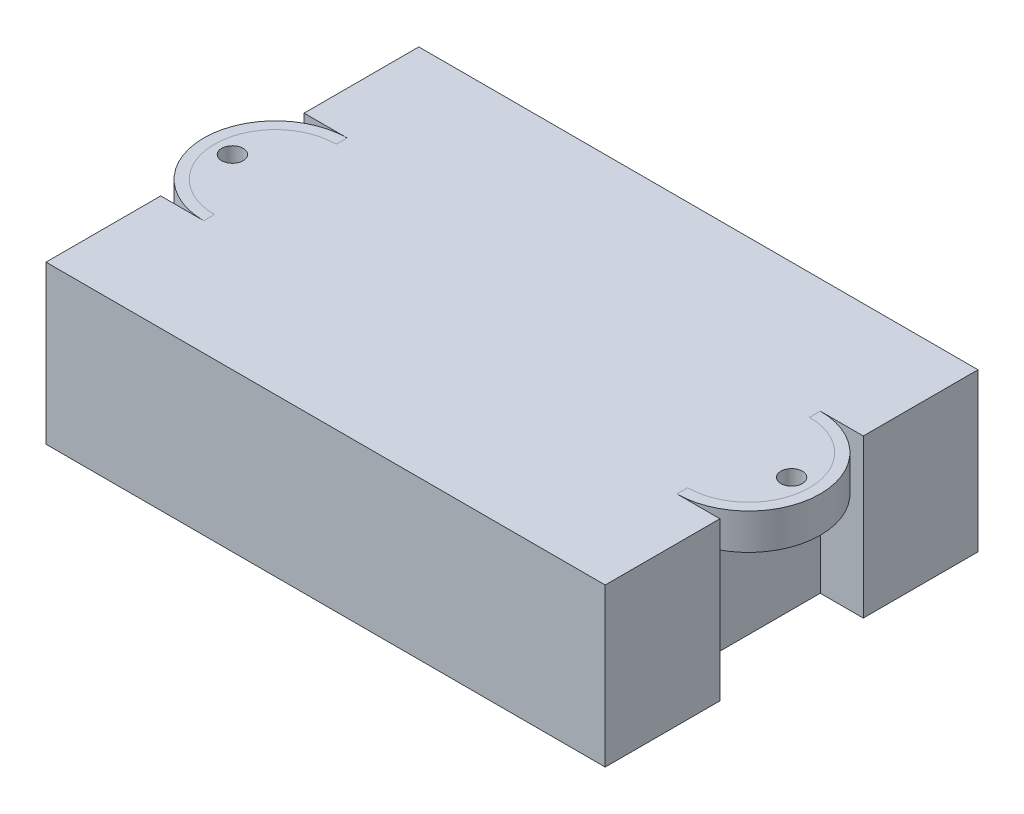
ISO-10303-21;
HEADER;
FILE_DESCRIPTION(('STEP AP214'),'2;1');
FILE_NAME('part.step','',(''),(''),'','','');
FILE_SCHEMA(('AUTOMOTIVE_DESIGN { 1 0 10303 214 1 1 1 1 }'));
ENDSEC;
DATA;
#1=APPLICATION_CONTEXT('core data for automotive mechanical design processes');
#2=APPLICATION_PROTOCOL_DEFINITION('international standard','automotive_design',2000,#1);
#3=PRODUCT_CONTEXT('',#1,'mechanical');
#4=PRODUCT('Part','Part','',(#3));
#5=PRODUCT_RELATED_PRODUCT_CATEGORY('part','',(#4));
#6=PRODUCT_DEFINITION_FORMATION('','',#4);
#7=PRODUCT_DEFINITION_CONTEXT('part definition',#1,'design');
#8=PRODUCT_DEFINITION('design','',#6,#7);
#9=PRODUCT_DEFINITION_SHAPE('','',#8);
#10=(LENGTH_UNIT() NAMED_UNIT(*) SI_UNIT(.MILLI.,.METRE.));
#11=(NAMED_UNIT(*) PLANE_ANGLE_UNIT() SI_UNIT($,.RADIAN.));
#12=(NAMED_UNIT(*) SI_UNIT($,.STERADIAN.) SOLID_ANGLE_UNIT());
#13=UNCERTAINTY_MEASURE_WITH_UNIT(LENGTH_MEASURE(1.E-05),#10,'distance_accuracy_value','');
#14=(GEOMETRIC_REPRESENTATION_CONTEXT(3) GLOBAL_UNCERTAINTY_ASSIGNED_CONTEXT((#13)) GLOBAL_UNIT_ASSIGNED_CONTEXT((#10,
#11,#12)) REPRESENTATION_CONTEXT('',''));
#15=CARTESIAN_POINT('',(0.,0.,0.));
#16=DIRECTION('',(0.,0.,1.));
#17=DIRECTION('',(1.,0.,0.));
#18=AXIS2_PLACEMENT_3D('',#15,#16,#17);
#19=CARTESIAN_POINT('',(-33.,17.,0.));
#20=DIRECTION('',(0.,1.,0.));
#21=DIRECTION('',(0.,0.,1.));
#22=AXIS2_PLACEMENT_3D('',#19,#20,#21);
#23=CYLINDRICAL_SURFACE('',#22,8.5);
#24=CARTESIAN_POINT('',(-33.,22.,0.));
#25=DIRECTION('',(0.,1.,0.));
#26=DIRECTION('',(0.,0.,1.));
#27=AXIS2_PLACEMENT_3D('',#24,#25,#26);
#28=CIRCLE('',#27,8.5);
#29=CARTESIAN_POINT('',(-33.,22.,-8.5));
#30=VERTEX_POINT('',#29);
#31=CARTESIAN_POINT('',(-33.,22.,8.5));
#32=VERTEX_POINT('',#31);
#33=EDGE_CURVE('E113',#30,#32,#28,.T.);
#34=ORIENTED_EDGE('',*,*,#33,.T.);
#35=DIRECTION('',(0.,1.,0.));
#36=VECTOR('',#35,1.);
#37=CARTESIAN_POINT('',(-33.,17.,8.5));
#38=LINE('',#37,#36);
#39=CARTESIAN_POINT('',(-33.,17.,8.5));
#40=VERTEX_POINT('',#39);
#41=EDGE_CURVE('E12',#40,#32,#38,.T.);
#42=ORIENTED_EDGE('',*,*,#41,.F.);
#43=CARTESIAN_POINT('',(-33.,17.,0.));
#44=DIRECTION('',(0.,1.,0.));
#45=DIRECTION('',(0.,0.,1.));
#46=AXIS2_PLACEMENT_3D('',#43,#44,#45);
#47=CIRCLE('',#46,8.5);
#48=CARTESIAN_POINT('',(-33.,17.,-8.5));
#49=VERTEX_POINT('',#48);
#50=EDGE_CURVE('E107',#49,#40,#47,.T.);
#51=ORIENTED_EDGE('',*,*,#50,.F.);
#52=DIRECTION('',(0.,1.,0.));
#53=VECTOR('',#52,1.);
#54=CARTESIAN_POINT('',(-33.,17.,-8.5));
#55=LINE('',#54,#53);
#56=EDGE_CURVE('E53',#49,#30,#55,.T.);
#57=ORIENTED_EDGE('',*,*,#56,.T.);
#58=EDGE_LOOP('',(#34,#42,#51,#57));
#59=FACE_BOUND('',#58,.T.);
#60=ADVANCED_FACE('F50',(#59),#23,.F.);
#61=CARTESIAN_POINT('',(-33.,17.,0.));
#62=DIRECTION('',(-1.,0.,0.));
#63=DIRECTION('',(0.,0.,1.));
#64=AXIS2_PLACEMENT_3D('',#61,#62,#63);
#65=PLANE('',#64);
#66=DIRECTION('',(0.,0.,1.));
#67=VECTOR('',#66,1.);
#68=CARTESIAN_POINT('',(-33.,22.,0.));
#69=LINE('',#68,#67);
#70=CARTESIAN_POINT('',(-33.,22.,10.));
#71=VERTEX_POINT('',#70);
#72=EDGE_CURVE('E89',#32,#71,#69,.T.);
#73=ORIENTED_EDGE('',*,*,#72,.T.);
#74=DIRECTION('',(0.,1.,0.));
#75=VECTOR('',#74,1.);
#76=CARTESIAN_POINT('',(-33.,17.,10.));
#77=LINE('',#76,#75);
#78=CARTESIAN_POINT('',(-33.,17.,10.));
#79=VERTEX_POINT('',#78);
#80=EDGE_CURVE('E59',#79,#71,#77,.T.);
#81=ORIENTED_EDGE('',*,*,#80,.F.);
#82=DIRECTION('',(0.,0.,1.));
#83=VECTOR('',#82,1.);
#84=CARTESIAN_POINT('',(-33.,17.,0.));
#85=LINE('',#84,#83);
#86=EDGE_CURVE('E67',#40,#79,#85,.T.);
#87=ORIENTED_EDGE('',*,*,#86,.F.);
#88=ORIENTED_EDGE('',*,*,#41,.T.);
#89=EDGE_LOOP('',(#73,#81,#87,#88));
#90=FACE_BOUND('',#89,.T.);
#91=ADVANCED_FACE('F121',(#90),#65,.F.);
#92=CARTESIAN_POINT('',(-33.,17.,0.));
#93=DIRECTION('',(0.,1.,0.));
#94=DIRECTION('',(0.,0.,1.));
#95=AXIS2_PLACEMENT_3D('',#92,#93,#94);
#96=CYLINDRICAL_SURFACE('',#95,10.);
#97=CARTESIAN_POINT('',(-33.,22.,0.));
#98=DIRECTION('',(0.,1.,0.));
#99=DIRECTION('',(0.,0.,1.));
#100=AXIS2_PLACEMENT_3D('',#97,#98,#99);
#101=CIRCLE('',#100,10.);
#102=CARTESIAN_POINT('',(-33.,22.,-10.));
#103=VERTEX_POINT('',#102);
#104=EDGE_CURVE('E101',#103,#71,#101,.T.);
#105=ORIENTED_EDGE('',*,*,#104,.F.);
#106=DIRECTION('',(0.,1.,0.));
#107=VECTOR('',#106,1.);
#108=CARTESIAN_POINT('',(-33.,17.,-10.));
#109=LINE('',#108,#107);
#110=CARTESIAN_POINT('',(-33.,17.,-10.));
#111=VERTEX_POINT('',#110);
#112=EDGE_CURVE('E98',#111,#103,#109,.T.);
#113=ORIENTED_EDGE('',*,*,#112,.F.);
#114=CARTESIAN_POINT('',(-33.,17.,0.));
#115=DIRECTION('',(0.,1.,0.));
#116=DIRECTION('',(0.,0.,1.));
#117=AXIS2_PLACEMENT_3D('',#114,#115,#116);
#118=CIRCLE('',#117,10.);
#119=EDGE_CURVE('E100',#111,#79,#118,.T.);
#120=ORIENTED_EDGE('',*,*,#119,.T.);
#121=ORIENTED_EDGE('',*,*,#80,.T.);
#122=EDGE_LOOP('',(#105,#113,#120,#121));
#123=FACE_BOUND('',#122,.T.);
#124=ADVANCED_FACE('F99',(#123),#96,.T.);
#125=EDGE_CURVE('E116',#103,#30,#69,.T.);
#126=ORIENTED_EDGE('',*,*,#125,.T.);
#127=ORIENTED_EDGE('',*,*,#56,.F.);
#128=EDGE_CURVE('E95',#111,#49,#85,.T.);
#129=ORIENTED_EDGE('',*,*,#128,.F.);
#130=ORIENTED_EDGE('',*,*,#112,.T.);
#131=EDGE_LOOP('',(#126,#127,#129,#130));
#132=FACE_BOUND('',#131,.T.);
#133=ADVANCED_FACE('F104',(#132),#65,.F.);
#134=CARTESIAN_POINT('',(0.,17.,0.));
#135=DIRECTION('',(0.,1.,0.));
#136=DIRECTION('',(0.,0.,1.));
#137=AXIS2_PLACEMENT_3D('',#134,#135,#136);
#138=PLANE('',#137);
#139=ORIENTED_EDGE('',*,*,#50,.T.);
#140=ORIENTED_EDGE('',*,*,#86,.T.);
#141=ORIENTED_EDGE('',*,*,#119,.F.);
#142=ORIENTED_EDGE('',*,*,#128,.T.);
#143=EDGE_LOOP('',(#139,#140,#141,#142));
#144=FACE_BOUND('',#143,.T.);
#145=ADVANCED_FACE('F109',(#144),#138,.F.);
#146=CARTESIAN_POINT('',(0.,22.,0.));
#147=DIRECTION('',(0.,1.,0.));
#148=DIRECTION('',(0.,0.,1.));
#149=AXIS2_PLACEMENT_3D('',#146,#147,#148);
#150=PLANE('',#149);
#151=ORIENTED_EDGE('',*,*,#33,.F.);
#152=ORIENTED_EDGE('',*,*,#125,.F.);
#153=ORIENTED_EDGE('',*,*,#104,.T.);
#154=ORIENTED_EDGE('',*,*,#72,.F.);
#155=EDGE_LOOP('',(#151,#152,#153,#154));
#156=FACE_BOUND('',#155,.T.);
#157=ADVANCED_FACE('F133',(#156),#150,.T.);
#158=CLOSED_SHELL('',(#60,#91,#124,#133,#145,#157));
#159=MANIFOLD_SOLID_BREP('B2',#158);
#160=CARTESIAN_POINT('',(33.,17.,0.));
#161=DIRECTION('',(1.,0.,0.));
#162=DIRECTION('',(0.,0.,-1.));
#163=AXIS2_PLACEMENT_3D('',#160,#161,#162);
#164=PLANE('',#163);
#165=DIRECTION('',(0.,0.,-1.));
#166=VECTOR('',#165,1.);
#167=CARTESIAN_POINT('',(33.,22.,0.));
#168=LINE('',#167,#166);
#169=CARTESIAN_POINT('',(33.,22.,-8.50000000000001));
#170=VERTEX_POINT('',#169);
#171=CARTESIAN_POINT('',(33.,22.,-9.99999999999999));
#172=VERTEX_POINT('',#171);
#173=EDGE_CURVE('E249',#170,#172,#168,.T.);
#174=ORIENTED_EDGE('',*,*,#173,.T.);
#175=DIRECTION('',(0.,1.,0.));
#176=VECTOR('',#175,1.);
#177=CARTESIAN_POINT('',(33.,17.,-9.99999999999999));
#178=LINE('',#177,#176);
#179=CARTESIAN_POINT('',(33.,17.,-9.99999999999999));
#180=VERTEX_POINT('',#179);
#181=EDGE_CURVE('E48',#180,#172,#178,.T.);
#182=ORIENTED_EDGE('',*,*,#181,.F.);
#183=DIRECTION('',(0.,0.,-1.));
#184=VECTOR('',#183,1.);
#185=CARTESIAN_POINT('',(33.,17.,0.));
#186=LINE('',#185,#184);
#187=CARTESIAN_POINT('',(33.,17.,-8.50000000000001));
#188=VERTEX_POINT('',#187);
#189=EDGE_CURVE('E240',#188,#180,#186,.T.);
#190=ORIENTED_EDGE('',*,*,#189,.F.);
#191=DIRECTION('',(0.,1.,0.));
#192=VECTOR('',#191,1.);
#193=CARTESIAN_POINT('',(33.,17.,-8.50000000000001));
#194=LINE('',#193,#192);
#195=EDGE_CURVE('E190',#188,#170,#194,.T.);
#196=ORIENTED_EDGE('',*,*,#195,.T.);
#197=EDGE_LOOP('',(#174,#182,#190,#196));
#198=FACE_BOUND('',#197,.T.);
#199=ADVANCED_FACE('F186',(#198),#164,.F.);
#200=CARTESIAN_POINT('',(33.,17.,0.));
#201=DIRECTION('',(0.,1.,0.));
#202=DIRECTION('',(0.,0.,1.));
#203=AXIS2_PLACEMENT_3D('',#200,#201,#202);
#204=CYLINDRICAL_SURFACE('',#203,10.);
#205=CARTESIAN_POINT('',(33.,22.,0.));
#206=DIRECTION('',(0.,1.,0.));
#207=DIRECTION('',(0.,0.,1.));
#208=AXIS2_PLACEMENT_3D('',#205,#206,#207);
#209=CIRCLE('',#208,10.);
#210=CARTESIAN_POINT('',(33.,22.,9.99999999999999));
#211=VERTEX_POINT('',#210);
#212=EDGE_CURVE('E218',#172,#211,#209,.F.);
#213=ORIENTED_EDGE('',*,*,#212,.T.);
#214=DIRECTION('',(0.,1.,0.));
#215=VECTOR('',#214,1.);
#216=CARTESIAN_POINT('',(33.,17.,9.99999999999999));
#217=LINE('',#216,#215);
#218=CARTESIAN_POINT('',(33.,17.,9.99999999999999));
#219=VERTEX_POINT('',#218);
#220=EDGE_CURVE('E196',#219,#211,#217,.T.);
#221=ORIENTED_EDGE('',*,*,#220,.F.);
#222=CARTESIAN_POINT('',(33.,17.,0.));
#223=DIRECTION('',(0.,1.,0.));
#224=DIRECTION('',(0.,0.,1.));
#225=AXIS2_PLACEMENT_3D('',#222,#223,#224);
#226=CIRCLE('',#225,10.);
#227=EDGE_CURVE('E204',#180,#219,#226,.F.);
#228=ORIENTED_EDGE('',*,*,#227,.F.);
#229=ORIENTED_EDGE('',*,*,#181,.T.);
#230=EDGE_LOOP('',(#213,#221,#228,#229));
#231=FACE_BOUND('',#230,.T.);
#232=ADVANCED_FACE('F258',(#231),#204,.T.);
#233=CARTESIAN_POINT('',(33.,22.,8.49999999999999));
#234=VERTEX_POINT('',#233);
#235=EDGE_CURVE('E244',#211,#234,#168,.T.);
#236=ORIENTED_EDGE('',*,*,#235,.T.);
#237=DIRECTION('',(0.,1.,0.));
#238=VECTOR('',#237,1.);
#239=CARTESIAN_POINT('',(33.,17.,8.49999999999999));
#240=LINE('',#239,#238);
#241=CARTESIAN_POINT('',(33.,17.,8.49999999999999));
#242=VERTEX_POINT('',#241);
#243=EDGE_CURVE('E242',#242,#234,#240,.T.);
#244=ORIENTED_EDGE('',*,*,#243,.F.);
#245=EDGE_CURVE('E234',#219,#242,#186,.T.);
#246=ORIENTED_EDGE('',*,*,#245,.F.);
#247=ORIENTED_EDGE('',*,*,#220,.T.);
#248=EDGE_LOOP('',(#236,#244,#246,#247));
#249=FACE_BOUND('',#248,.T.);
#250=ADVANCED_FACE('F243',(#249),#164,.F.);
#251=CARTESIAN_POINT('',(33.,17.,0.));
#252=DIRECTION('',(0.,1.,0.));
#253=DIRECTION('',(0.,0.,1.));
#254=AXIS2_PLACEMENT_3D('',#251,#252,#253);
#255=CYLINDRICAL_SURFACE('',#254,8.5);
#256=CARTESIAN_POINT('',(33.,22.,0.));
#257=DIRECTION('',(0.,1.,0.));
#258=DIRECTION('',(0.,0.,1.));
#259=AXIS2_PLACEMENT_3D('',#256,#257,#258);
#260=CIRCLE('',#259,8.5);
#261=EDGE_CURVE('E252',#170,#234,#260,.F.);
#262=ORIENTED_EDGE('',*,*,#261,.F.);
#263=ORIENTED_EDGE('',*,*,#195,.F.);
#264=CARTESIAN_POINT('',(33.,17.,0.));
#265=DIRECTION('',(0.,1.,0.));
#266=DIRECTION('',(0.,0.,1.));
#267=AXIS2_PLACEMENT_3D('',#264,#265,#266);
#268=CIRCLE('',#267,8.5);
#269=EDGE_CURVE('E237',#188,#242,#268,.F.);
#270=ORIENTED_EDGE('',*,*,#269,.T.);
#271=ORIENTED_EDGE('',*,*,#243,.T.);
#272=EDGE_LOOP('',(#262,#263,#270,#271));
#273=FACE_BOUND('',#272,.T.);
#274=ADVANCED_FACE('F188',(#273),#255,.F.);
#275=CARTESIAN_POINT('',(0.,17.,0.));
#276=DIRECTION('',(0.,1.,0.));
#277=DIRECTION('',(0.,0.,1.));
#278=AXIS2_PLACEMENT_3D('',#275,#276,#277);
#279=PLANE('',#278);
#280=ORIENTED_EDGE('',*,*,#189,.T.);
#281=ORIENTED_EDGE('',*,*,#227,.T.);
#282=ORIENTED_EDGE('',*,*,#245,.T.);
#283=ORIENTED_EDGE('',*,*,#269,.F.);
#284=EDGE_LOOP('',(#280,#281,#282,#283));
#285=FACE_BOUND('',#284,.T.);
#286=ADVANCED_FACE('F236',(#285),#279,.F.);
#287=CARTESIAN_POINT('',(0.,22.,0.));
#288=DIRECTION('',(0.,1.,0.));
#289=DIRECTION('',(0.,0.,1.));
#290=AXIS2_PLACEMENT_3D('',#287,#288,#289);
#291=PLANE('',#290);
#292=ORIENTED_EDGE('',*,*,#173,.F.);
#293=ORIENTED_EDGE('',*,*,#261,.T.);
#294=ORIENTED_EDGE('',*,*,#235,.F.);
#295=ORIENTED_EDGE('',*,*,#212,.F.);
#296=EDGE_LOOP('',(#292,#293,#294,#295));
#297=FACE_BOUND('',#296,.T.);
#298=ADVANCED_FACE('F255',(#297),#291,.T.);
#299=CLOSED_SHELL('',(#199,#232,#250,#274,#286,#298));
#300=MANIFOLD_SOLID_BREP('B6',#299);
#301=CARTESIAN_POINT('',(33.,0.,-9.99999999999999));
#302=DIRECTION('',(-1.,0.,0.));
#303=DIRECTION('',(0.,0.,1.));
#304=AXIS2_PLACEMENT_3D('',#301,#302,#303);
#305=PLANE('',#304);
#306=DIRECTION('',(0.,1.,0.));
#307=VECTOR('',#306,1.);
#308=CARTESIAN_POINT('',(33.,18.,8.49999999999999));
#309=LINE('',#308,#307);
#310=CARTESIAN_POINT('',(33.,18.,8.49999999999999));
#311=VERTEX_POINT('',#310);
#312=CARTESIAN_POINT('',(33.,22.,8.49999999999999));
#313=VERTEX_POINT('',#312);
#314=EDGE_CURVE('E465',#311,#313,#309,.T.);
#315=ORIENTED_EDGE('',*,*,#314,.T.);
#316=DIRECTION('',(0.,0.,1.));
#317=VECTOR('',#316,1.);
#318=CARTESIAN_POINT('',(33.,22.,-9.99999999999999));
#319=LINE('',#318,#317);
#320=CARTESIAN_POINT('',(33.,22.,9.99999999999999));
#321=VERTEX_POINT('',#320);
#322=EDGE_CURVE('E468',#313,#321,#319,.T.);
#323=ORIENTED_EDGE('',*,*,#322,.T.);
#324=DIRECTION('',(0.,1.,0.));
#325=VECTOR('',#324,1.);
#326=CARTESIAN_POINT('',(33.,0.,9.99999999999999));
#327=LINE('',#326,#325);
#328=CARTESIAN_POINT('',(33.,0.,9.99999999999999));
#329=VERTEX_POINT('',#328);
#330=EDGE_CURVE('E504',#329,#321,#327,.T.);
#331=ORIENTED_EDGE('',*,*,#330,.F.);
#332=DIRECTION('',(0.,0.,1.));
#333=VECTOR('',#332,1.);
#334=CARTESIAN_POINT('',(33.,0.,-9.99999999999999));
#335=LINE('',#334,#333);
#336=CARTESIAN_POINT('',(33.,0.,-9.99999999999999));
#337=VERTEX_POINT('',#336);
#338=EDGE_CURVE('E494',#337,#329,#335,.T.);
#339=ORIENTED_EDGE('',*,*,#338,.F.);
#340=DIRECTION('',(0.,1.,0.));
#341=VECTOR('',#340,1.);
#342=CARTESIAN_POINT('',(33.,0.,-9.99999999999999));
#343=LINE('',#342,#341);
#344=CARTESIAN_POINT('',(33.,22.,-9.99999999999999));
#345=VERTEX_POINT('',#344);
#346=EDGE_CURVE('E482',#337,#345,#343,.T.);
#347=ORIENTED_EDGE('',*,*,#346,.T.);
#348=CARTESIAN_POINT('',(33.,22.,-8.50000000000001));
#349=VERTEX_POINT('',#348);
#350=EDGE_CURVE('E505',#345,#349,#319,.T.);
#351=ORIENTED_EDGE('',*,*,#350,.T.);
#352=DIRECTION('',(0.,1.,0.));
#353=VECTOR('',#352,1.);
#354=CARTESIAN_POINT('',(33.,18.,-8.50000000000001));
#355=LINE('',#354,#353);
#356=CARTESIAN_POINT('',(33.,18.,-8.50000000000001));
#357=VERTEX_POINT('',#356);
#358=EDGE_CURVE('E460',#357,#349,#355,.T.);
#359=ORIENTED_EDGE('',*,*,#358,.F.);
#360=DIRECTION('',(0.,0.,-1.));
#361=VECTOR('',#360,1.);
#362=CARTESIAN_POINT('',(33.,18.,0.));
#363=LINE('',#362,#361);
#364=EDGE_CURVE('E453',#311,#357,#363,.T.);
#365=ORIENTED_EDGE('',*,*,#364,.F.);
#366=EDGE_LOOP('',(#315,#323,#331,#339,#347,#351,#359,#365));
#367=FACE_BOUND('',#366,.T.);
#368=ADVANCED_FACE('F307',(#367),#305,.F.);
#369=CARTESIAN_POINT('',(39.,22.,-26.));
#370=DIRECTION('',(-1.,0.,0.));
#371=DIRECTION('',(0.,0.,1.));
#372=AXIS2_PLACEMENT_3D('',#369,#370,#371);
#373=PLANE('',#372);
#374=DIRECTION('',(0.,0.,-1.));
#375=VECTOR('',#374,1.);
#376=CARTESIAN_POINT('',(39.,22.,-26.));
#377=LINE('',#376,#375);
#378=CARTESIAN_POINT('',(39.,22.,-9.99999999999999));
#379=VERTEX_POINT('',#378);
#380=CARTESIAN_POINT('',(39.,22.,-26.));
#381=VERTEX_POINT('',#380);
#382=EDGE_CURVE('E523',#379,#381,#377,.T.);
#383=ORIENTED_EDGE('',*,*,#382,.F.);
#384=DIRECTION('',(0.,1.,0.));
#385=VECTOR('',#384,1.);
#386=CARTESIAN_POINT('',(39.,0.,-9.99999999999999));
#387=LINE('',#386,#385);
#388=CARTESIAN_POINT('',(39.,0.,-9.99999999999999));
#389=VERTEX_POINT('',#388);
#390=EDGE_CURVE('E512',#389,#379,#387,.T.);
#391=ORIENTED_EDGE('',*,*,#390,.F.);
#392=DIRECTION('',(0.,0.,-1.));
#393=VECTOR('',#392,1.);
#394=CARTESIAN_POINT('',(39.,0.,-26.));
#395=LINE('',#394,#393);
#396=CARTESIAN_POINT('',(39.,0.,-26.));
#397=VERTEX_POINT('',#396);
#398=EDGE_CURVE('E488',#389,#397,#395,.T.);
#399=ORIENTED_EDGE('',*,*,#398,.T.);
#400=DIRECTION('',(0.,-1.,0.));
#401=VECTOR('',#400,1.);
#402=CARTESIAN_POINT('',(39.,22.,-26.));
#403=LINE('',#402,#401);
#404=EDGE_CURVE('E184',#381,#397,#403,.T.);
#405=ORIENTED_EDGE('',*,*,#404,.F.);
#406=EDGE_LOOP('',(#383,#391,#399,#405));
#407=FACE_BOUND('',#406,.T.);
#408=ADVANCED_FACE('F566',(#407),#373,.F.);
#409=CARTESIAN_POINT('',(-39.,22.,-26.));
#410=DIRECTION('',(1.,0.,0.));
#411=DIRECTION('',(0.,0.,-1.));
#412=AXIS2_PLACEMENT_3D('',#409,#410,#411);
#413=PLANE('',#412);
#414=DIRECTION('',(0.,0.,1.));
#415=VECTOR('',#414,1.);
#416=CARTESIAN_POINT('',(-39.,0.,-26.));
#417=LINE('',#416,#415);
#418=CARTESIAN_POINT('',(-39.,0.,-26.));
#419=VERTEX_POINT('',#418);
#420=CARTESIAN_POINT('',(-39.,0.,-10.));
#421=VERTEX_POINT('',#420);
#422=EDGE_CURVE('E537',#419,#421,#417,.T.);
#423=ORIENTED_EDGE('',*,*,#422,.T.);
#424=DIRECTION('',(0.,1.,0.));
#425=VECTOR('',#424,1.);
#426=CARTESIAN_POINT('',(-39.,0.,-10.));
#427=LINE('',#426,#425);
#428=CARTESIAN_POINT('',(-39.,22.,-10.));
#429=VERTEX_POINT('',#428);
#430=EDGE_CURVE('E485',#421,#429,#427,.T.);
#431=ORIENTED_EDGE('',*,*,#430,.T.);
#432=DIRECTION('',(0.,0.,1.));
#433=VECTOR('',#432,1.);
#434=CARTESIAN_POINT('',(-39.,22.,-26.));
#435=LINE('',#434,#433);
#436=CARTESIAN_POINT('',(-39.,22.,-26.));
#437=VERTEX_POINT('',#436);
#438=EDGE_CURVE('E526',#437,#429,#435,.T.);
#439=ORIENTED_EDGE('',*,*,#438,.F.);
#440=DIRECTION('',(0.,-1.,0.));
#441=VECTOR('',#440,1.);
#442=CARTESIAN_POINT('',(-39.,22.,-26.));
#443=LINE('',#442,#441);
#444=EDGE_CURVE('E315',#437,#419,#443,.T.);
#445=ORIENTED_EDGE('',*,*,#444,.T.);
#446=EDGE_LOOP('',(#423,#431,#439,#445));
#447=FACE_BOUND('',#446,.T.);
#448=ADVANCED_FACE('F551',(#447),#413,.F.);
#449=CARTESIAN_POINT('',(39.,0.,26.));
#450=VERTEX_POINT('',#449);
#451=CARTESIAN_POINT('',(39.,0.,9.99999999999998));
#452=VERTEX_POINT('',#451);
#453=EDGE_CURVE('E531',#450,#452,#395,.T.);
#454=ORIENTED_EDGE('',*,*,#453,.T.);
#455=DIRECTION('',(0.,1.,0.));
#456=VECTOR('',#455,1.);
#457=CARTESIAN_POINT('',(39.,0.,9.99999999999999));
#458=LINE('',#457,#456);
#459=CARTESIAN_POINT('',(39.,22.,9.99999999999999));
#460=VERTEX_POINT('',#459);
#461=EDGE_CURVE('E514',#452,#460,#458,.T.);
#462=ORIENTED_EDGE('',*,*,#461,.T.);
#463=CARTESIAN_POINT('',(39.,22.,26.));
#464=VERTEX_POINT('',#463);
#465=EDGE_CURVE('E519',#464,#460,#377,.T.);
#466=ORIENTED_EDGE('',*,*,#465,.F.);
#467=DIRECTION('',(0.,-1.,0.));
#468=VECTOR('',#467,1.);
#469=CARTESIAN_POINT('',(39.,22.,26.));
#470=LINE('',#469,#468);
#471=EDGE_CURVE('E530',#464,#450,#470,.T.);
#472=ORIENTED_EDGE('',*,*,#471,.T.);
#473=EDGE_LOOP('',(#454,#462,#466,#472));
#474=FACE_BOUND('',#473,.T.);
#475=ADVANCED_FACE('F309',(#474),#373,.F.);
#476=CARTESIAN_POINT('',(-39.,22.,-26.));
#477=DIRECTION('',(0.,0.,1.));
#478=DIRECTION('',(1.,0.,0.));
#479=AXIS2_PLACEMENT_3D('',#476,#477,#478);
#480=PLANE('',#479);
#481=DIRECTION('',(-1.,0.,0.));
#482=VECTOR('',#481,1.);
#483=CARTESIAN_POINT('',(-39.,0.,-26.));
#484=LINE('',#483,#482);
#485=EDGE_CURVE('E534',#397,#419,#484,.T.);
#486=ORIENTED_EDGE('',*,*,#485,.T.);
#487=ORIENTED_EDGE('',*,*,#444,.F.);
#488=DIRECTION('',(-1.,0.,0.));
#489=VECTOR('',#488,1.);
#490=CARTESIAN_POINT('',(-39.,22.,-26.));
#491=LINE('',#490,#489);
#492=EDGE_CURVE('E522',#381,#437,#491,.T.);
#493=ORIENTED_EDGE('',*,*,#492,.F.);
#494=ORIENTED_EDGE('',*,*,#404,.T.);
#495=EDGE_LOOP('',(#486,#487,#493,#494));
#496=FACE_BOUND('',#495,.T.);
#497=ADVANCED_FACE('F564',(#496),#480,.F.);
#498=CARTESIAN_POINT('',(-39.,22.,10.));
#499=VERTEX_POINT('',#498);
#500=CARTESIAN_POINT('',(-39.,22.,26.));
#501=VERTEX_POINT('',#500);
#502=EDGE_CURVE('E525',#499,#501,#435,.T.);
#503=ORIENTED_EDGE('',*,*,#502,.F.);
#504=DIRECTION('',(0.,1.,0.));
#505=VECTOR('',#504,1.);
#506=CARTESIAN_POINT('',(-39.,0.,10.));
#507=LINE('',#506,#505);
#508=CARTESIAN_POINT('',(-39.,0.,10.));
#509=VERTEX_POINT('',#508);
#510=EDGE_CURVE('E480',#509,#499,#507,.T.);
#511=ORIENTED_EDGE('',*,*,#510,.F.);
#512=CARTESIAN_POINT('',(-39.,0.,26.));
#513=VERTEX_POINT('',#512);
#514=EDGE_CURVE('E536',#509,#513,#417,.T.);
#515=ORIENTED_EDGE('',*,*,#514,.T.);
#516=DIRECTION('',(0.,-1.,0.));
#517=VECTOR('',#516,1.);
#518=CARTESIAN_POINT('',(-39.,22.,26.));
#519=LINE('',#518,#517);
#520=EDGE_CURVE('E544',#501,#513,#519,.T.);
#521=ORIENTED_EDGE('',*,*,#520,.F.);
#522=EDGE_LOOP('',(#503,#511,#515,#521));
#523=FACE_BOUND('',#522,.T.);
#524=ADVANCED_FACE('F590',(#523),#413,.F.);
#525=CARTESIAN_POINT('',(-39.,22.,26.));
#526=DIRECTION('',(0.,0.,-1.));
#527=DIRECTION('',(-1.,0.,0.));
#528=AXIS2_PLACEMENT_3D('',#525,#526,#527);
#529=PLANE('',#528);
#530=DIRECTION('',(1.,0.,0.));
#531=VECTOR('',#530,1.);
#532=CARTESIAN_POINT('',(-39.,0.,26.));
#533=LINE('',#532,#531);
#534=EDGE_CURVE('E540',#513,#450,#533,.T.);
#535=ORIENTED_EDGE('',*,*,#534,.T.);
#536=ORIENTED_EDGE('',*,*,#471,.F.);
#537=DIRECTION('',(1.,0.,0.));
#538=VECTOR('',#537,1.);
#539=CARTESIAN_POINT('',(-39.,22.,26.));
#540=LINE('',#539,#538);
#541=EDGE_CURVE('E528',#501,#464,#540,.T.);
#542=ORIENTED_EDGE('',*,*,#541,.F.);
#543=ORIENTED_EDGE('',*,*,#520,.T.);
#544=EDGE_LOOP('',(#535,#536,#542,#543));
#545=FACE_BOUND('',#544,.T.);
#546=ADVANCED_FACE('F584',(#545),#529,.F.);
#547=CARTESIAN_POINT('',(0.,22.,0.));
#548=DIRECTION('',(0.,1.,0.));
#549=DIRECTION('',(0.,0.,1.));
#550=AXIS2_PLACEMENT_3D('',#547,#548,#549);
#551=PLANE('',#550);
#552=DIRECTION('',(-1.,0.,0.));
#553=VECTOR('',#552,1.);
#554=CARTESIAN_POINT('',(-39.,22.,-10.));
#555=LINE('',#554,#553);
#556=CARTESIAN_POINT('',(-33.,22.,-10.));
#557=VERTEX_POINT('',#556);
#558=EDGE_CURVE('E426',#557,#429,#555,.T.);
#559=ORIENTED_EDGE('',*,*,#558,.F.);
#560=DIRECTION('',(0.,0.,-1.));
#561=VECTOR('',#560,1.);
#562=CARTESIAN_POINT('',(-33.,22.,-10.));
#563=LINE('',#562,#561);
#564=CARTESIAN_POINT('',(-33.,22.,-8.5));
#565=VERTEX_POINT('',#564);
#566=EDGE_CURVE('E419',#565,#557,#563,.T.);
#567=ORIENTED_EDGE('',*,*,#566,.F.);
#568=CARTESIAN_POINT('',(-33.,22.,0.));
#569=DIRECTION('',(0.,1.,0.));
#570=DIRECTION('',(0.,0.,1.));
#571=AXIS2_PLACEMENT_3D('',#568,#569,#570);
#572=CIRCLE('',#571,8.5);
#573=CARTESIAN_POINT('',(-33.,22.,8.5));
#574=VERTEX_POINT('',#573);
#575=EDGE_CURVE('E424',#565,#574,#572,.T.);
#576=ORIENTED_EDGE('',*,*,#575,.T.);
#577=CARTESIAN_POINT('',(-33.,22.,10.));
#578=VERTEX_POINT('',#577);
#579=EDGE_CURVE('E428',#578,#574,#563,.T.);
#580=ORIENTED_EDGE('',*,*,#579,.F.);
#581=DIRECTION('',(1.,0.,0.));
#582=VECTOR('',#581,1.);
#583=CARTESIAN_POINT('',(-33.,22.,10.));
#584=LINE('',#583,#582);
#585=EDGE_CURVE('E429',#499,#578,#584,.T.);
#586=ORIENTED_EDGE('',*,*,#585,.F.);
#587=ORIENTED_EDGE('',*,*,#502,.T.);
#588=ORIENTED_EDGE('',*,*,#541,.T.);
#589=ORIENTED_EDGE('',*,*,#465,.T.);
#590=DIRECTION('',(1.,0.,0.));
#591=VECTOR('',#590,1.);
#592=CARTESIAN_POINT('',(33.,22.,9.99999999999999));
#593=LINE('',#592,#591);
#594=EDGE_CURVE('E507',#321,#460,#593,.T.);
#595=ORIENTED_EDGE('',*,*,#594,.F.);
#596=ORIENTED_EDGE('',*,*,#322,.F.);
#597=CARTESIAN_POINT('',(33.,22.,0.));
#598=DIRECTION('',(0.,1.,0.));
#599=DIRECTION('',(0.,0.,1.));
#600=AXIS2_PLACEMENT_3D('',#597,#598,#599);
#601=CIRCLE('',#600,8.5);
#602=EDGE_CURVE('E448',#349,#313,#601,.F.);
#603=ORIENTED_EDGE('',*,*,#602,.F.);
#604=ORIENTED_EDGE('',*,*,#350,.F.);
#605=DIRECTION('',(-1.,0.,0.));
#606=VECTOR('',#605,1.);
#607=CARTESIAN_POINT('',(39.,22.,-9.99999999999999));
#608=LINE('',#607,#606);
#609=EDGE_CURVE('E498',#379,#345,#608,.T.);
#610=ORIENTED_EDGE('',*,*,#609,.F.);
#611=ORIENTED_EDGE('',*,*,#382,.T.);
#612=ORIENTED_EDGE('',*,*,#492,.T.);
#613=ORIENTED_EDGE('',*,*,#438,.T.);
#614=EDGE_LOOP('',(#559,#567,#576,#580,#586,#587,#588,#589,#595,#596,#603,#604,#610,#611,#612,#613));
#615=FACE_BOUND('',#614,.T.);
#616=CARTESIAN_POINT('',(39.,22.,0.));
#617=DIRECTION('',(0.,1.,0.));
#618=DIRECTION('',(0.,0.,1.));
#619=AXIS2_PLACEMENT_3D('',#616,#617,#618);
#620=CIRCLE('',#619,1.5);
#621=CARTESIAN_POINT('',(39.,22.,1.5));
#622=VERTEX_POINT('',#621);
#623=EDGE_CURVE('E454',#622,#622,#620,.F.);
#624=ORIENTED_EDGE('',*,*,#623,.T.);
#625=EDGE_LOOP('',(#624));
#626=FACE_BOUND('',#625,.T.);
#627=CARTESIAN_POINT('',(-39.,22.,0.));
#628=DIRECTION('',(0.,1.,0.));
#629=DIRECTION('',(0.,0.,1.));
#630=AXIS2_PLACEMENT_3D('',#627,#628,#629);
#631=CIRCLE('',#630,1.5);
#632=CARTESIAN_POINT('',(-39.,22.,1.5));
#633=VERTEX_POINT('',#632);
#634=EDGE_CURVE('E440',#633,#633,#631,.T.);
#635=ORIENTED_EDGE('',*,*,#634,.F.);
#636=EDGE_LOOP('',(#635));
#637=FACE_BOUND('',#636,.T.);
#638=ADVANCED_FACE('F420',(#615,#626,#637),#551,.T.);
#639=CARTESIAN_POINT('',(0.,0.,0.));
#640=DIRECTION('',(0.,1.,0.));
#641=DIRECTION('',(0.,0.,1.));
#642=AXIS2_PLACEMENT_3D('',#639,#640,#641);
#643=PLANE('',#642);
#644=DIRECTION('',(0.,0.,-1.));
#645=VECTOR('',#644,1.);
#646=CARTESIAN_POINT('',(-33.,0.,-10.));
#647=LINE('',#646,#645);
#648=CARTESIAN_POINT('',(-33.,0.,10.));
#649=VERTEX_POINT('',#648);
#650=CARTESIAN_POINT('',(-33.,0.,-10.));
#651=VERTEX_POINT('',#650);
#652=EDGE_CURVE('E474',#649,#651,#647,.T.);
#653=ORIENTED_EDGE('',*,*,#652,.T.);
#654=DIRECTION('',(-1.,0.,0.));
#655=VECTOR('',#654,1.);
#656=CARTESIAN_POINT('',(-39.,0.,-10.));
#657=LINE('',#656,#655);
#658=EDGE_CURVE('E477',#651,#421,#657,.T.);
#659=ORIENTED_EDGE('',*,*,#658,.T.);
#660=ORIENTED_EDGE('',*,*,#422,.F.);
#661=ORIENTED_EDGE('',*,*,#485,.F.);
#662=ORIENTED_EDGE('',*,*,#398,.F.);
#663=DIRECTION('',(-1.,0.,0.));
#664=VECTOR('',#663,1.);
#665=CARTESIAN_POINT('',(39.,0.,-9.99999999999999));
#666=LINE('',#665,#664);
#667=EDGE_CURVE('E501',#389,#337,#666,.T.);
#668=ORIENTED_EDGE('',*,*,#667,.T.);
#669=ORIENTED_EDGE('',*,*,#338,.T.);
#670=DIRECTION('',(1.,0.,0.));
#671=VECTOR('',#670,1.);
#672=CARTESIAN_POINT('',(33.,0.,9.99999999999999));
#673=LINE('',#672,#671);
#674=EDGE_CURVE('E497',#329,#452,#673,.T.);
#675=ORIENTED_EDGE('',*,*,#674,.T.);
#676=ORIENTED_EDGE('',*,*,#453,.F.);
#677=ORIENTED_EDGE('',*,*,#534,.F.);
#678=ORIENTED_EDGE('',*,*,#514,.F.);
#679=DIRECTION('',(1.,0.,0.));
#680=VECTOR('',#679,1.);
#681=CARTESIAN_POINT('',(-33.,0.,10.));
#682=LINE('',#681,#680);
#683=EDGE_CURVE('E471',#509,#649,#682,.T.);
#684=ORIENTED_EDGE('',*,*,#683,.T.);
#685=EDGE_LOOP('',(#653,#659,#660,#661,#662,#668,#669,#675,#676,#677,#678,#684));
#686=FACE_BOUND('',#685,.T.);
#687=ADVANCED_FACE('F556',(#686),#643,.F.);
#688=CARTESIAN_POINT('',(39.,0.,-9.99999999999999));
#689=DIRECTION('',(0.,0.,-1.));
#690=DIRECTION('',(-1.,0.,0.));
#691=AXIS2_PLACEMENT_3D('',#688,#689,#690);
#692=PLANE('',#691);
#693=ORIENTED_EDGE('',*,*,#609,.T.);
#694=ORIENTED_EDGE('',*,*,#346,.F.);
#695=ORIENTED_EDGE('',*,*,#667,.F.);
#696=ORIENTED_EDGE('',*,*,#390,.T.);
#697=EDGE_LOOP('',(#693,#694,#695,#696));
#698=FACE_BOUND('',#697,.T.);
#699=ADVANCED_FACE('F570',(#698),#692,.F.);
#700=CARTESIAN_POINT('',(33.,0.,9.99999999999999));
#701=DIRECTION('',(0.,0.,1.));
#702=DIRECTION('',(1.,0.,0.));
#703=AXIS2_PLACEMENT_3D('',#700,#701,#702);
#704=PLANE('',#703);
#705=ORIENTED_EDGE('',*,*,#594,.T.);
#706=ORIENTED_EDGE('',*,*,#461,.F.);
#707=ORIENTED_EDGE('',*,*,#674,.F.);
#708=ORIENTED_EDGE('',*,*,#330,.T.);
#709=EDGE_LOOP('',(#705,#706,#707,#708));
#710=FACE_BOUND('',#709,.T.);
#711=ADVANCED_FACE('F576',(#710),#704,.F.);
#712=CARTESIAN_POINT('',(-39.,0.,-10.));
#713=DIRECTION('',(0.,0.,-1.));
#714=DIRECTION('',(-1.,0.,0.));
#715=AXIS2_PLACEMENT_3D('',#712,#713,#714);
#716=PLANE('',#715);
#717=ORIENTED_EDGE('',*,*,#558,.T.);
#718=ORIENTED_EDGE('',*,*,#430,.F.);
#719=ORIENTED_EDGE('',*,*,#658,.F.);
#720=DIRECTION('',(0.,1.,0.));
#721=VECTOR('',#720,1.);
#722=CARTESIAN_POINT('',(-33.,0.,-10.));
#723=LINE('',#722,#721);
#724=EDGE_CURVE('E489',#651,#557,#723,.T.);
#725=ORIENTED_EDGE('',*,*,#724,.T.);
#726=EDGE_LOOP('',(#717,#718,#719,#725));
#727=FACE_BOUND('',#726,.T.);
#728=ADVANCED_FACE('F560',(#727),#716,.F.);
#729=CARTESIAN_POINT('',(-33.,0.,-10.));
#730=DIRECTION('',(1.,0.,0.));
#731=DIRECTION('',(0.,0.,-1.));
#732=AXIS2_PLACEMENT_3D('',#729,#730,#731);
#733=PLANE('',#732);
#734=DIRECTION('',(0.,0.,1.));
#735=VECTOR('',#734,1.);
#736=CARTESIAN_POINT('',(-33.,18.,0.));
#737=LINE('',#736,#735);
#738=CARTESIAN_POINT('',(-33.,18.,-8.5));
#739=VERTEX_POINT('',#738);
#740=CARTESIAN_POINT('',(-33.,18.,8.5));
#741=VERTEX_POINT('',#740);
#742=EDGE_CURVE('E326',#739,#741,#737,.T.);
#743=ORIENTED_EDGE('',*,*,#742,.F.);
#744=DIRECTION('',(0.,1.,0.));
#745=VECTOR('',#744,1.);
#746=CARTESIAN_POINT('',(-33.,18.,-8.5));
#747=LINE('',#746,#745);
#748=EDGE_CURVE('E431',#739,#565,#747,.T.);
#749=ORIENTED_EDGE('',*,*,#748,.T.);
#750=ORIENTED_EDGE('',*,*,#566,.T.);
#751=ORIENTED_EDGE('',*,*,#724,.F.);
#752=ORIENTED_EDGE('',*,*,#652,.F.);
#753=DIRECTION('',(0.,1.,0.));
#754=VECTOR('',#753,1.);
#755=CARTESIAN_POINT('',(-33.,0.,10.));
#756=LINE('',#755,#754);
#757=EDGE_CURVE('E491',#649,#578,#756,.T.);
#758=ORIENTED_EDGE('',*,*,#757,.T.);
#759=ORIENTED_EDGE('',*,*,#579,.T.);
#760=DIRECTION('',(0.,1.,0.));
#761=VECTOR('',#760,1.);
#762=CARTESIAN_POINT('',(-33.,18.,8.5));
#763=LINE('',#762,#761);
#764=EDGE_CURVE('E322',#741,#574,#763,.T.);
#765=ORIENTED_EDGE('',*,*,#764,.F.);
#766=EDGE_LOOP('',(#743,#749,#750,#751,#752,#758,#759,#765));
#767=FACE_BOUND('',#766,.T.);
#768=ADVANCED_FACE('F432',(#767),#733,.F.);
#769=CARTESIAN_POINT('',(-33.,0.,10.));
#770=DIRECTION('',(0.,0.,1.));
#771=DIRECTION('',(1.,0.,0.));
#772=AXIS2_PLACEMENT_3D('',#769,#770,#771);
#773=PLANE('',#772);
#774=ORIENTED_EDGE('',*,*,#585,.T.);
#775=ORIENTED_EDGE('',*,*,#757,.F.);
#776=ORIENTED_EDGE('',*,*,#683,.F.);
#777=ORIENTED_EDGE('',*,*,#510,.T.);
#778=EDGE_LOOP('',(#774,#775,#776,#777));
#779=FACE_BOUND('',#778,.T.);
#780=ADVANCED_FACE('F593',(#779),#773,.F.);
#781=CARTESIAN_POINT('',(33.,18.,0.));
#782=DIRECTION('',(0.,1.,0.));
#783=DIRECTION('',(0.,0.,1.));
#784=AXIS2_PLACEMENT_3D('',#781,#782,#783);
#785=CYLINDRICAL_SURFACE('',#784,8.5);
#786=ORIENTED_EDGE('',*,*,#602,.T.);
#787=ORIENTED_EDGE('',*,*,#314,.F.);
#788=CARTESIAN_POINT('',(33.,18.,0.));
#789=DIRECTION('',(0.,1.,0.));
#790=DIRECTION('',(0.,0.,1.));
#791=AXIS2_PLACEMENT_3D('',#788,#789,#790);
#792=CIRCLE('',#791,8.5);
#793=EDGE_CURVE('E450',#357,#311,#792,.F.);
#794=ORIENTED_EDGE('',*,*,#793,.F.);
#795=ORIENTED_EDGE('',*,*,#358,.T.);
#796=EDGE_LOOP('',(#786,#787,#794,#795));
#797=FACE_BOUND('',#796,.T.);
#798=ADVANCED_FACE('F599',(#797),#785,.T.);
#799=CARTESIAN_POINT('',(39.,18.,0.));
#800=DIRECTION('',(0.,1.,0.));
#801=DIRECTION('',(0.,0.,1.));
#802=AXIS2_PLACEMENT_3D('',#799,#800,#801);
#803=CYLINDRICAL_SURFACE('',#802,1.5);
#804=CARTESIAN_POINT('',(39.,18.,0.));
#805=DIRECTION('',(0.,1.,0.));
#806=DIRECTION('',(0.,0.,1.));
#807=AXIS2_PLACEMENT_3D('',#804,#805,#806);
#808=CIRCLE('',#807,1.5);
#809=CARTESIAN_POINT('',(39.,18.,1.5));
#810=VERTEX_POINT('',#809);
#811=EDGE_CURVE('E457',#810,#810,#808,.F.);
#812=ORIENTED_EDGE('',*,*,#811,.T.);
#813=EDGE_LOOP('',(#812));
#814=FACE_BOUND('',#813,.T.);
#815=ORIENTED_EDGE('',*,*,#623,.F.);
#816=EDGE_LOOP('',(#815));
#817=FACE_BOUND('',#816,.T.);
#818=ADVANCED_FACE('F605',(#814,#817),#803,.F.);
#819=CARTESIAN_POINT('',(0.,18.,0.));
#820=DIRECTION('',(0.,1.,0.));
#821=DIRECTION('',(0.,0.,1.));
#822=AXIS2_PLACEMENT_3D('',#819,#820,#821);
#823=PLANE('',#822);
#824=ORIENTED_EDGE('',*,*,#793,.T.);
#825=ORIENTED_EDGE('',*,*,#364,.T.);
#826=EDGE_LOOP('',(#824,#825));
#827=FACE_BOUND('',#826,.T.);
#828=ORIENTED_EDGE('',*,*,#811,.F.);
#829=EDGE_LOOP('',(#828));
#830=FACE_BOUND('',#829,.T.);
#831=ADVANCED_FACE('F601',(#827,#830),#823,.F.);
#832=CARTESIAN_POINT('',(-39.,18.,0.));
#833=DIRECTION('',(0.,1.,0.));
#834=DIRECTION('',(0.,0.,1.));
#835=AXIS2_PLACEMENT_3D('',#832,#833,#834);
#836=CYLINDRICAL_SURFACE('',#835,1.5);
#837=CARTESIAN_POINT('',(-39.,18.,0.));
#838=DIRECTION('',(0.,1.,0.));
#839=DIRECTION('',(0.,0.,1.));
#840=AXIS2_PLACEMENT_3D('',#837,#838,#839);
#841=CIRCLE('',#840,1.5);
#842=CARTESIAN_POINT('',(-39.,18.,1.5));
#843=VERTEX_POINT('',#842);
#844=EDGE_CURVE('E439',#843,#843,#841,.T.);
#845=ORIENTED_EDGE('',*,*,#844,.F.);
#846=EDGE_LOOP('',(#845));
#847=FACE_BOUND('',#846,.T.);
#848=ORIENTED_EDGE('',*,*,#634,.T.);
#849=EDGE_LOOP('',(#848));
#850=FACE_BOUND('',#849,.T.);
#851=ADVANCED_FACE('F604',(#847,#850),#836,.F.);
#852=CARTESIAN_POINT('',(-33.,18.,0.));
#853=DIRECTION('',(0.,1.,0.));
#854=DIRECTION('',(0.,0.,1.));
#855=AXIS2_PLACEMENT_3D('',#852,#853,#854);
#856=CYLINDRICAL_SURFACE('',#855,8.5);
#857=ORIENTED_EDGE('',*,*,#575,.F.);
#858=ORIENTED_EDGE('',*,*,#748,.F.);
#859=CARTESIAN_POINT('',(-33.,18.,0.));
#860=DIRECTION('',(0.,1.,0.));
#861=DIRECTION('',(0.,0.,1.));
#862=AXIS2_PLACEMENT_3D('',#859,#860,#861);
#863=CIRCLE('',#862,8.5);
#864=EDGE_CURVE('E436',#739,#741,#863,.T.);
#865=ORIENTED_EDGE('',*,*,#864,.T.);
#866=ORIENTED_EDGE('',*,*,#764,.T.);
#867=EDGE_LOOP('',(#857,#858,#865,#866));
#868=FACE_BOUND('',#867,.T.);
#869=ADVANCED_FACE('F438',(#868),#856,.T.);
#870=CARTESIAN_POINT('',(0.,18.,0.));
#871=DIRECTION('',(0.,1.,0.));
#872=DIRECTION('',(0.,0.,1.));
#873=AXIS2_PLACEMENT_3D('',#870,#871,#872);
#874=PLANE('',#873);
#875=ORIENTED_EDGE('',*,*,#844,.T.);
#876=EDGE_LOOP('',(#875));
#877=FACE_BOUND('',#876,.T.);
#878=ORIENTED_EDGE('',*,*,#742,.T.);
#879=ORIENTED_EDGE('',*,*,#864,.F.);
#880=EDGE_LOOP('',(#878,#879));
#881=FACE_BOUND('',#880,.T.);
#882=ADVANCED_FACE('F624',(#877,#881),#874,.F.);
#883=CLOSED_SHELL('',(#368,#408,#448,#475,#497,#524,#546,#638,#687,#699,#711,#728,#768,#780,
#798,#818,#831,#851,#869,#882));
#884=MANIFOLD_SOLID_BREP('B42',#883);
#885=ADVANCED_BREP_SHAPE_REPRESENTATION('',(#18,#159,#300,#884),#14);
#886=SHAPE_DEFINITION_REPRESENTATION(#9,#885);
ENDSEC;
END-ISO-10303-21;
